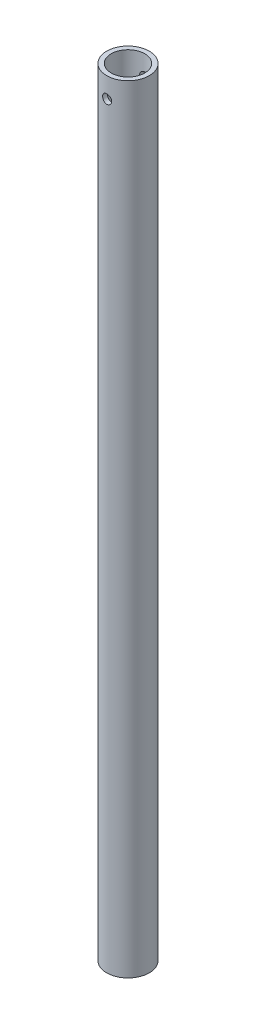
ISO-10303-21;
HEADER;
FILE_DESCRIPTION(('STEP AP214'),'2;1');
FILE_NAME('part.step','',(''),(''),'','','');
FILE_SCHEMA(('AUTOMOTIVE_DESIGN { 1 0 10303 214 1 1 1 1 }'));
ENDSEC;
DATA;
#1=APPLICATION_CONTEXT('core data for automotive mechanical design processes');
#2=APPLICATION_PROTOCOL_DEFINITION('international standard','automotive_design',2000,#1);
#3=PRODUCT_CONTEXT('',#1,'mechanical');
#4=PRODUCT('Part','Part','',(#3));
#5=PRODUCT_RELATED_PRODUCT_CATEGORY('part','',(#4));
#6=PRODUCT_DEFINITION_FORMATION('','',#4);
#7=PRODUCT_DEFINITION_CONTEXT('part definition',#1,'design');
#8=PRODUCT_DEFINITION('design','',#6,#7);
#9=PRODUCT_DEFINITION_SHAPE('','',#8);
#10=(LENGTH_UNIT() NAMED_UNIT(*) SI_UNIT(.MILLI.,.METRE.));
#11=(NAMED_UNIT(*) PLANE_ANGLE_UNIT() SI_UNIT($,.RADIAN.));
#12=(NAMED_UNIT(*) SI_UNIT($,.STERADIAN.) SOLID_ANGLE_UNIT());
#13=UNCERTAINTY_MEASURE_WITH_UNIT(LENGTH_MEASURE(1.E-05),#10,'distance_accuracy_value','');
#14=(GEOMETRIC_REPRESENTATION_CONTEXT(3) GLOBAL_UNCERTAINTY_ASSIGNED_CONTEXT((#13)) GLOBAL_UNIT_ASSIGNED_CONTEXT((#10,
#11,#12)) REPRESENTATION_CONTEXT('',''));
#15=CARTESIAN_POINT('',(0.,0.,0.));
#16=DIRECTION('',(0.,0.,1.));
#17=DIRECTION('',(1.,0.,0.));
#18=AXIS2_PLACEMENT_3D('',#15,#16,#17);
#19=CARTESIAN_POINT('',(0.,0.,0.));
#20=DIRECTION('',(0.,1.,0.));
#21=DIRECTION('',(0.,0.,1.));
#22=AXIS2_PLACEMENT_3D('',#19,#20,#21);
#23=PLANE('',#22);
#24=CARTESIAN_POINT('',(0.,0.,0.));
#25=DIRECTION('',(0.,1.,0.));
#26=DIRECTION('',(0.,0.,1.));
#27=AXIS2_PLACEMENT_3D('',#24,#25,#26);
#28=CIRCLE('',#27,13.1445);
#29=CARTESIAN_POINT('',(0.,0.,13.1445));
#30=VERTEX_POINT('',#29);
#31=EDGE_CURVE('E93',#30,#30,#28,.T.);
#32=ORIENTED_EDGE('',*,*,#31,.T.);
#33=EDGE_LOOP('',(#32));
#34=FACE_BOUND('',#33,.T.);
#35=CARTESIAN_POINT('',(0.,0.,0.));
#36=DIRECTION('',(0.,1.,0.));
#37=DIRECTION('',(0.,0.,1.));
#38=AXIS2_PLACEMENT_3D('',#35,#36,#37);
#39=CIRCLE('',#38,16.7005);
#40=CARTESIAN_POINT('',(0.,0.,16.7005));
#41=VERTEX_POINT('',#40);
#42=EDGE_CURVE('E62',#41,#41,#39,.T.);
#43=ORIENTED_EDGE('',*,*,#42,.F.);
#44=EDGE_LOOP('',(#43));
#45=FACE_BOUND('',#44,.T.);
#46=ADVANCED_FACE('F38',(#34,#45),#23,.F.);
#47=CARTESIAN_POINT('',(0.,609.6,0.));
#48=DIRECTION('',(0.,1.,0.));
#49=DIRECTION('',(0.,0.,1.));
#50=AXIS2_PLACEMENT_3D('',#47,#48,#49);
#51=PLANE('',#50);
#52=CARTESIAN_POINT('',(0.,609.6,0.));
#53=DIRECTION('',(0.,1.,0.));
#54=DIRECTION('',(0.,0.,1.));
#55=AXIS2_PLACEMENT_3D('',#52,#53,#54);
#56=CIRCLE('',#55,13.1445);
#57=CARTESIAN_POINT('',(0.,609.6,13.1445));
#58=VERTEX_POINT('',#57);
#59=EDGE_CURVE('E94',#58,#58,#56,.T.);
#60=ORIENTED_EDGE('',*,*,#59,.F.);
#61=EDGE_LOOP('',(#60));
#62=FACE_BOUND('',#61,.T.);
#63=CARTESIAN_POINT('',(0.,609.6,0.));
#64=DIRECTION('',(0.,1.,0.));
#65=DIRECTION('',(0.,0.,1.));
#66=AXIS2_PLACEMENT_3D('',#63,#64,#65);
#67=CIRCLE('',#66,16.7005);
#68=CARTESIAN_POINT('',(0.,609.6,16.7005));
#69=VERTEX_POINT('',#68);
#70=EDGE_CURVE('E57',#69,#69,#67,.T.);
#71=ORIENTED_EDGE('',*,*,#70,.T.);
#72=EDGE_LOOP('',(#71));
#73=FACE_BOUND('',#72,.T.);
#74=ADVANCED_FACE('F104',(#62,#73),#51,.T.);
#75=CARTESIAN_POINT('',(0.,0.,0.));
#76=DIRECTION('',(0.,1.,0.));
#77=DIRECTION('',(0.,0.,1.));
#78=AXIS2_PLACEMENT_3D('',#75,#76,#77);
#79=CYLINDRICAL_SURFACE('',#78,16.7005);
#80=CARTESIAN_POINT('',(0.,590.15376,16.7005));
#81=CARTESIAN_POINT('',(0.198180128467397,590.153766916919,16.7004963337488));
#82=CARTESIAN_POINT('',(0.39644485112555,590.170312231521,16.6969364344142));
#83=CARTESIAN_POINT('',(0.787350043252914,590.235991986569,16.6830790056128));
#84=CARTESIAN_POINT('',(0.979986263864115,590.285150414705,16.6727765168931));
#85=CARTESIAN_POINT('',(1.35392789600151,590.41445216763,16.6465819057805));
#86=CARTESIAN_POINT('',(1.53524466181015,590.494563844422,16.6306954941354));
#87=CARTESIAN_POINT('',(1.88185554342918,590.683399266575,16.5950509562576));
#88=CARTESIAN_POINT('',(2.04715021727184,590.792122014952,16.5752929649404));
#89=CARTESIAN_POINT('',(2.35957433760585,591.036863258493,16.533732772831));
#90=CARTESIAN_POINT('',(2.506422105691,591.173237216087,16.5119061563597));
#91=CARTESIAN_POINT('',(2.77534243826499,591.468646328024,16.4688422330848));
#92=CARTESIAN_POINT('',(2.89741287037584,591.627683430791,16.4476049771382));
#93=CARTESIAN_POINT('',(3.11454439668957,591.965971846837,16.4078842607787));
#94=CARTESIAN_POINT('',(3.20930782685882,592.145418222158,16.3894321223851));
#95=CARTESIAN_POINT('',(3.36722665713713,592.518147724438,16.3577203528158));
#96=CARTESIAN_POINT('',(3.43038565777865,592.711429272356,16.344460130189));
#97=CARTESIAN_POINT('',(3.52237626915555,593.103293597183,16.3248818041431));
#98=CARTESIAN_POINT('',(3.55170540502194,593.301754451834,16.3184631931365));
#99=CARTESIAN_POINT('',(3.57675029818604,593.700875634117,16.3129928008047));
#100=CARTESIAN_POINT('',(3.57246999855778,593.901535700977,16.3139401553009));
#101=CARTESIAN_POINT('',(3.53081840543797,594.2956765251,16.3230035707971));
#102=CARTESIAN_POINT('',(3.49402300808806,594.489221443267,16.3309948658002));
#103=CARTESIAN_POINT('',(3.38929719409495,594.867326102776,16.3530487038793));
#104=CARTESIAN_POINT('',(3.32136510009737,595.051885359462,16.3671115740326));
#105=CARTESIAN_POINT('',(3.15575979431064,595.408409635789,16.3998482170195));
#106=CARTESIAN_POINT('',(3.05786331339642,595.580267656282,16.4185563981669));
#107=CARTESIAN_POINT('',(2.83526528773563,595.905330916877,16.4584543585796));
#108=CARTESIAN_POINT('',(2.7105602424186,596.058533716948,16.4796444617611));
#109=CARTESIAN_POINT('',(2.43482710263058,596.345255326748,16.5226554031));
#110=CARTESIAN_POINT('',(2.28330880638853,596.478302568999,16.5444802322143));
#111=CARTESIAN_POINT('',(1.95986606623161,596.717172829153,16.5859026211323));
#112=CARTESIAN_POINT('',(1.78794128373359,596.822995395252,16.60550014397));
#113=CARTESIAN_POINT('',(1.42800424917503,597.004520971383,16.640319071282));
#114=CARTESIAN_POINT('',(1.23996101241435,597.08016431524,16.6555317904193));
#115=CARTESIAN_POINT('',(0.853435955602256,597.198650346792,16.6798021685141));
#116=CARTESIAN_POINT('',(0.65495558908012,597.241497588984,16.6888606821055));
#117=CARTESIAN_POINT('',(0.257237341000125,597.292494173422,16.6996810595956));
#118=CARTESIAN_POINT('',(0.0580856758665553,597.301287993776,16.7015784339077));
#119=CARTESIAN_POINT('',(-0.338841041559328,597.285671931545,16.6982415869446));
#120=CARTESIAN_POINT('',(-0.536616182056808,597.261264196515,16.6930078269279));
#121=CARTESIAN_POINT('',(-0.923055503089254,597.180472584674,16.6760821070637));
#122=CARTESIAN_POINT('',(-1.11179317921705,597.12442476495,16.6644580535049));
#123=CARTESIAN_POINT('',(-1.47718935720897,596.982315426609,16.6360520092218));
#124=CARTESIAN_POINT('',(-1.65384686043098,596.896251430197,16.6192695926952));
#125=CARTESIAN_POINT('',(-1.99274729308006,596.695196191905,16.582073127143));
#126=CARTESIAN_POINT('',(-2.15475886597971,596.579823807051,16.5616123561023));
#127=CARTESIAN_POINT('',(-2.45735342289598,596.323930935095,16.519427852075));
#128=CARTESIAN_POINT('',(-2.59793375129851,596.183407336107,16.4977039630315));
#129=CARTESIAN_POINT('',(-2.85620706916956,595.878249667119,16.4549765882197));
#130=CARTESIAN_POINT('',(-2.97345477690698,595.713235526423,16.4339924530576));
#131=CARTESIAN_POINT('',(-3.17857365224335,595.365478675312,16.3955574560704));
#132=CARTESIAN_POINT('',(-3.26644607009319,595.182736719843,16.3781064438835));
#133=CARTESIAN_POINT('',(-3.40974035959568,594.805679451086,16.3488753221426));
#134=CARTESIAN_POINT('',(-3.46534145186944,594.611434789018,16.3370639587312));
#135=CARTESIAN_POINT('',(-3.54304526295326,594.216076085678,16.3203902691574));
#136=CARTESIAN_POINT('',(-3.56515306772184,594.014963092106,16.3155268879497));
#137=CARTESIAN_POINT('',(-3.57503377692477,593.61606092668,16.3133641927147));
#138=CARTESIAN_POINT('',(-3.56351201079232,593.41828973885,16.3159094897465));
#139=CARTESIAN_POINT('',(-3.50803204004136,593.027576162751,16.3279270777278));
#140=CARTESIAN_POINT('',(-3.46407418324189,592.834633722725,16.3373992943985));
#141=CARTESIAN_POINT('',(-3.34530372068774,592.459584875812,16.3621293538191));
#142=CARTESIAN_POINT('',(-3.27058943160135,592.277446037371,16.3773687486721));
#143=CARTESIAN_POINT('',(-3.09251308657374,591.928182390882,16.4119241284166));
#144=CARTESIAN_POINT('',(-2.98914819936011,591.761059068841,16.4312405161545));
#145=CARTESIAN_POINT('',(-2.75434664612804,591.443083912176,16.4722406318213));
#146=CARTESIAN_POINT('',(-2.6224054816834,591.292609516566,16.4939629360763));
#147=CARTESIAN_POINT('',(-2.33522440786867,591.015705309254,16.5370634914949));
#148=CARTESIAN_POINT('',(-2.17997913159185,590.889281051512,16.5584416621459));
#149=CARTESIAN_POINT('',(-1.8483006757458,590.662584629503,16.5987561419888));
#150=CARTESIAN_POINT('',(-1.67163071978423,590.562652676979,16.6176592413828));
#151=CARTESIAN_POINT('',(-1.30363871792517,590.394059063511,16.6505624274905));
#152=CARTESIAN_POINT('',(-1.11232937398777,590.325370645372,16.6645667072064));
#153=CARTESIAN_POINT('',(-0.767301801157866,590.233743342312,16.6835354670588));
#154=CARTESIAN_POINT('',(-0.615477781700589,590.203805789594,16.6898583548463));
#155=CARTESIAN_POINT('',(-0.309119591274204,590.163811825327,16.6983419665027));
#156=CARTESIAN_POINT('',(-0.1545855308649,590.153754604627,16.700502859769));
#157=CARTESIAN_POINT('',(0.,590.15376,16.7005));
#158=B_SPLINE_CURVE_WITH_KNOTS('',3,(#80,#81,#82,#83,#84,#85,#86,#87,#88,#89,#90,#91,#92,#93,
#94,#95,#96,#97,#98,#99,#100,#101,#102,#103,#104,#105,#106,#107,#108,#109,#110,#111,#112,#113,
#114,#115,#116,#117,#118,#119,#120,#121,#122,#123,#124,#125,#126,#127,#128,#129,#130,#131,#132,
#133,#134,#135,#136,#137,#138,#139,#140,#141,#142,#143,#144,#145,#146,#147,#148,#149,#150,#151,
#152,#153,#154,#155,#156,#157),.UNSPECIFIED.,.T.,.F.,(4,2,2,2,2,2,2,2,2,2,2,2,2,2,2,2,2,2,2,2,2,
2,2,2,2,2,2,2,2,2,2,2,2,2,2,2,2,2,4),(0.,0.593974629123738,1.18838662522063,1.7821924691207,
2.37597762396337,2.977944459589,3.57996307951795,4.18831526537019,4.79659812895343,
5.39581628516933,5.99496414189277,6.58370815049623,7.17248387885598,7.76575810309693,
8.35910984215814,8.96470890985258,9.57031802701425,10.1771186067958,10.7838349030117,
11.3790110060325,11.9741486135033,12.5630809374933,13.1520618885512,13.7491338953982,
14.3462798273166,14.9539123201624,15.5615189480783,16.1657180887493,16.7698254725308,
17.361354257063,17.9528766985994,18.5425227716931,19.1322271348166,19.7333425626662,
20.3345966396108,20.9432341055184,21.5513493438405,22.014683490752,22.4779987790882),.UNSPECIFIED.);
#159=CARTESIAN_POINT('',(0.,590.15376,16.7005));
#160=VERTEX_POINT('',#159);
#161=EDGE_CURVE('E11',#160,#160,#158,.T.);
#162=ORIENTED_EDGE('',*,*,#161,.F.);
#163=EDGE_LOOP('',(#162));
#164=FACE_BOUND('',#163,.T.);
#165=CARTESIAN_POINT('',(0.,597.29624,-16.7005));
#166=CARTESIAN_POINT('',(0.198180128467397,597.29623308308,-16.7004963337488));
#167=CARTESIAN_POINT('',(0.39644485112555,597.279687768478,-16.6969364344142));
#168=CARTESIAN_POINT('',(0.787350043252914,597.21400801343,-16.6830790056128));
#169=CARTESIAN_POINT('',(0.979986263864115,597.164849585295,-16.6727765168931));
#170=CARTESIAN_POINT('',(1.35392789600151,597.03554783237,-16.6465819057805));
#171=CARTESIAN_POINT('',(1.53524466181015,596.955436155577,-16.6306954941354));
#172=CARTESIAN_POINT('',(1.88185554342918,596.766600733424,-16.5950509562576));
#173=CARTESIAN_POINT('',(2.04715021727184,596.657877985048,-16.5752929649404));
#174=CARTESIAN_POINT('',(2.35957433760585,596.413136741506,-16.533732772831));
#175=CARTESIAN_POINT('',(2.506422105691,596.276762783912,-16.5119061563597));
#176=CARTESIAN_POINT('',(2.77534243826499,595.981353671976,-16.4688422330848));
#177=CARTESIAN_POINT('',(2.89741287037584,595.822316569209,-16.4476049771382));
#178=CARTESIAN_POINT('',(3.11454439668957,595.484028153163,-16.4078842607787));
#179=CARTESIAN_POINT('',(3.20930782685882,595.304581777842,-16.3894321223851));
#180=CARTESIAN_POINT('',(3.36722665713713,594.931852275562,-16.3577203528158));
#181=CARTESIAN_POINT('',(3.43038565777865,594.738570727643,-16.344460130189));
#182=CARTESIAN_POINT('',(3.52237626915555,594.346706402817,-16.3248818041431));
#183=CARTESIAN_POINT('',(3.55170540502194,594.148245548166,-16.3184631931365));
#184=CARTESIAN_POINT('',(3.57675029818604,593.749124365883,-16.3129928008047));
#185=CARTESIAN_POINT('',(3.57246999855779,593.548464299023,-16.3139401553009));
#186=CARTESIAN_POINT('',(3.53081840543798,593.154323474899,-16.3230035707971));
#187=CARTESIAN_POINT('',(3.49402300808809,592.960778556733,-16.3309948658002));
#188=CARTESIAN_POINT('',(3.38929719409502,592.582673897224,-16.3530487038793));
#189=CARTESIAN_POINT('',(3.32136510009741,592.398114640538,-16.3671115740326));
#190=CARTESIAN_POINT('',(3.15575979431064,592.041590364211,-16.3998482170195));
#191=CARTESIAN_POINT('',(3.05786331339642,591.869732343717,-16.4185563981669));
#192=CARTESIAN_POINT('',(2.83526528773563,591.544669083122,-16.4584543585796));
#193=CARTESIAN_POINT('',(2.7105602424186,591.391466283051,-16.4796444617611));
#194=CARTESIAN_POINT('',(2.43482710263058,591.104744673252,-16.5226554031));
#195=CARTESIAN_POINT('',(2.28330880638853,590.971697431,-16.5444802322143));
#196=CARTESIAN_POINT('',(1.95986606623161,590.732827170847,-16.5859026211323));
#197=CARTESIAN_POINT('',(1.78794128373359,590.627004604748,-16.60550014397));
#198=CARTESIAN_POINT('',(1.42800424917501,590.445479028617,-16.640319071282));
#199=CARTESIAN_POINT('',(1.23996101241431,590.36983568476,-16.6555317904193));
#200=CARTESIAN_POINT('',(0.853435955602212,590.251349653207,-16.6798021685141));
#201=CARTESIAN_POINT('',(0.654955589080099,590.208502411016,-16.6888606821055));
#202=CARTESIAN_POINT('',(0.257237341000129,590.157505826577,-16.6996810595956));
#203=CARTESIAN_POINT('',(0.0580856758665614,590.148712006224,-16.7015784339077));
#204=CARTESIAN_POINT('',(-0.338841041559322,590.164328068455,-16.6982415869446));
#205=CARTESIAN_POINT('',(-0.536616182056806,590.188735803485,-16.6930078269279));
#206=CARTESIAN_POINT('',(-0.923055503089254,590.269527415326,-16.6760821070637));
#207=CARTESIAN_POINT('',(-1.11179317921705,590.325575235049,-16.6644580535049));
#208=CARTESIAN_POINT('',(-1.47718935720897,590.467684573391,-16.6360520092218));
#209=CARTESIAN_POINT('',(-1.65384686043098,590.553748569802,-16.6192695926952));
#210=CARTESIAN_POINT('',(-1.99274729308006,590.754803808094,-16.582073127143));
#211=CARTESIAN_POINT('',(-2.15475886597971,590.870176192948,-16.5616123561023));
#212=CARTESIAN_POINT('',(-2.45735342289598,591.126069064905,-16.519427852075));
#213=CARTESIAN_POINT('',(-2.59793375129851,591.266592663893,-16.4977039630315));
#214=CARTESIAN_POINT('',(-2.85620706916956,591.57175033288,-16.4549765882197));
#215=CARTESIAN_POINT('',(-2.97345477690698,591.736764473577,-16.4339924530576));
#216=CARTESIAN_POINT('',(-3.17857365224335,592.084521324688,-16.3955574560704));
#217=CARTESIAN_POINT('',(-3.26644607009319,592.267263280157,-16.3781064438835));
#218=CARTESIAN_POINT('',(-3.40974035959568,592.644320548914,-16.3488753221426));
#219=CARTESIAN_POINT('',(-3.46534145186944,592.838565210982,-16.3370639587312));
#220=CARTESIAN_POINT('',(-3.54304526295326,593.233923914322,-16.3203902691574));
#221=CARTESIAN_POINT('',(-3.56515306772184,593.435036907894,-16.3155268879497));
#222=CARTESIAN_POINT('',(-3.57503377692477,593.833939073319,-16.3133641927147));
#223=CARTESIAN_POINT('',(-3.56351201079232,594.03171026115,-16.3159094897465));
#224=CARTESIAN_POINT('',(-3.50803204004136,594.422423837249,-16.3279270777278));
#225=CARTESIAN_POINT('',(-3.46407418324189,594.615366277274,-16.3373992943985));
#226=CARTESIAN_POINT('',(-3.34530372068771,594.990415124188,-16.3621293538191));
#227=CARTESIAN_POINT('',(-3.27058943160127,595.172553962629,-16.3773687486721));
#228=CARTESIAN_POINT('',(-3.09251308657364,595.521817609118,-16.4119241284166));
#229=CARTESIAN_POINT('',(-2.98914819936006,595.688940931159,-16.4312405161545));
#230=CARTESIAN_POINT('',(-2.75434664612805,596.006916087824,-16.4722406318213));
#231=CARTESIAN_POINT('',(-2.6224054816834,596.157390483433,-16.4939629360763));
#232=CARTESIAN_POINT('',(-2.33522440786867,596.434294690746,-16.5370634914949));
#233=CARTESIAN_POINT('',(-2.17997913159185,596.560718948487,-16.5584416621459));
#234=CARTESIAN_POINT('',(-1.8483006757458,596.787415370497,-16.5987561419888));
#235=CARTESIAN_POINT('',(-1.67163071978423,596.887347323021,-16.6176592413828));
#236=CARTESIAN_POINT('',(-1.30363871792517,597.055940936489,-16.6505624274905));
#237=CARTESIAN_POINT('',(-1.11232937398777,597.124629354628,-16.6645667072064));
#238=CARTESIAN_POINT('',(-0.767301801157866,597.216256657688,-16.6835354670588));
#239=CARTESIAN_POINT('',(-0.615477781700589,597.246194210406,-16.6898583548463));
#240=CARTESIAN_POINT('',(-0.309119591274204,597.286188174673,-16.6983419665027));
#241=CARTESIAN_POINT('',(-0.1545855308649,597.296245395373,-16.700502859769));
#242=CARTESIAN_POINT('',(0.,597.29624,-16.7005));
#243=B_SPLINE_CURVE_WITH_KNOTS('',3,(#165,#166,#167,#168,#169,#170,#171,#172,#173,#174,#175,
#176,#177,#178,#179,#180,#181,#182,#183,#184,#185,#186,#187,#188,#189,#190,#191,#192,#193,#194,
#195,#196,#197,#198,#199,#200,#201,#202,#203,#204,#205,#206,#207,#208,#209,#210,#211,#212,#213,
#214,#215,#216,#217,#218,#219,#220,#221,#222,#223,#224,#225,#226,#227,#228,#229,#230,#231,#232,
#233,#234,#235,#236,#237,#238,#239,#240,#241,#242),.UNSPECIFIED.,.T.,.F.,(4,2,2,2,2,2,2,2,2,2,2,
2,2,2,2,2,2,2,2,2,2,2,2,2,2,2,2,2,2,2,2,2,2,2,2,2,2,2,4),(0.,0.593974629123738,1.18838662522063,
1.7821924691207,2.37597762396337,2.977944459589,3.57996307951795,4.18831526537019,
4.79659812895343,5.39581628516933,5.99496414189277,6.58370815049589,7.17248387885598,
7.76575810309693,8.35910984215813,8.96470890985258,9.57031802701425,10.1771186067958,
10.7838349030117,11.3790110060325,11.9741486135033,12.5630809374933,13.1520618885512,
13.7491338953982,14.3462798273166,14.9539123201624,15.5615189480783,16.1657180887493,
16.7698254725308,17.361354257063,17.9528766985994,18.5425227716934,19.1322271348166,
19.7333425626662,20.3345966396108,20.9432341055184,21.5513493438405,22.014683490752,
22.4779987790882),.UNSPECIFIED.);
#244=CARTESIAN_POINT('',(0.,597.29624,-16.7005));
#245=VERTEX_POINT('',#244);
#246=EDGE_CURVE('E50',#245,#245,#243,.T.);
#247=ORIENTED_EDGE('',*,*,#246,.F.);
#248=EDGE_LOOP('',(#247));
#249=FACE_BOUND('',#248,.T.);
#250=ORIENTED_EDGE('',*,*,#70,.F.);
#251=EDGE_LOOP('',(#250));
#252=FACE_BOUND('',#251,.T.);
#253=ORIENTED_EDGE('',*,*,#42,.T.);
#254=EDGE_LOOP('',(#253));
#255=FACE_BOUND('',#254,.T.);
#256=ADVANCED_FACE('F68',(#164,#249,#252,#255),#79,.T.);
#257=CARTESIAN_POINT('',(0.,0.,0.));
#258=DIRECTION('',(0.,1.,0.));
#259=DIRECTION('',(0.,0.,1.));
#260=AXIS2_PLACEMENT_3D('',#257,#258,#259);
#261=CYLINDRICAL_SURFACE('',#260,13.1445);
#262=CARTESIAN_POINT('',(0.,590.15376,13.1445));
#263=CARTESIAN_POINT('',(0.196734814294615,590.153764378364,13.1444971760718));
#264=CARTESIAN_POINT('',(0.393516001561489,590.170071213926,13.1400398888218));
#265=CARTESIAN_POINT('',(0.78140069505591,590.234746649612,13.1226921056815));
#266=CARTESIAN_POINT('',(0.972501578845284,590.28312982546,13.109797775972));
#267=CARTESIAN_POINT('',(1.34337133102817,590.410262055463,13.0769976305413));
#268=CARTESIAN_POINT('',(1.52315475811126,590.488971129889,13.0571010491192));
#269=CARTESIAN_POINT('',(1.86696995059322,590.674370376731,13.0123940642889));
#270=CARTESIAN_POINT('',(2.03100050744225,590.781062693664,12.9875832843131));
#271=CARTESIAN_POINT('',(2.34258889548332,591.022101565236,12.9350564225104));
#272=CARTESIAN_POINT('',(2.48971499848659,591.156995073441,12.9072892095964));
#273=CARTESIAN_POINT('',(2.75955970986045,591.449438514433,12.8523038782919));
#274=CARTESIAN_POINT('',(2.8822750478221,591.606991478134,12.825085833914));
#275=CARTESIAN_POINT('',(3.10194349061531,591.9437571414,12.7737550574884));
#276=CARTESIAN_POINT('',(3.19839560101738,592.123307350828,12.7497067033389));
#277=CARTESIAN_POINT('',(3.35957111332819,592.496835208983,12.7081917492458));
#278=CARTESIAN_POINT('',(3.42430061388786,592.690810076313,12.690723884357));
#279=CARTESIAN_POINT('',(3.51868580557237,593.082889538336,12.6648763017439));
#280=CARTESIAN_POINT('',(3.54912621235336,593.280791518654,12.6562936327321));
#281=CARTESIAN_POINT('',(3.57651621518975,593.6790650825,12.6485822015427));
#282=CARTESIAN_POINT('',(3.57347232770244,593.879436177925,12.6494515998757));
#283=CARTESIAN_POINT('',(3.53460216942576,594.270799554918,12.6603646788483));
#284=CARTESIAN_POINT('',(3.49973009718289,594.46189524522,12.6701413083803));
#285=CARTESIAN_POINT('',(3.39972365258786,594.835415910685,12.6973390361955));
#286=CARTESIAN_POINT('',(3.33458677974115,595.017840168035,12.7147607661145));
#287=CARTESIAN_POINT('',(3.17513315267934,595.371304632213,12.7555173528351));
#288=CARTESIAN_POINT('',(3.08048552975019,595.542187589351,12.7789186859865));
#289=CARTESIAN_POINT('',(2.86492777444314,595.865978804228,12.8289625547442));
#290=CARTESIAN_POINT('',(2.74401229573363,596.018883393026,12.8556057496846));
#291=CARTESIAN_POINT('',(2.47449233792716,596.307823773253,12.9102388632684));
#292=CARTESIAN_POINT('',(2.32508786696849,596.443111584833,12.9382438103255));
#293=CARTESIAN_POINT('',(2.00536825434316,596.686868197862,12.9916360733779));
#294=CARTESIAN_POINT('',(1.83505222578218,596.795335861236,13.0170232782664));
#295=CARTESIAN_POINT('',(1.47715710542602,596.982719974395,13.062485740196));
#296=CARTESIAN_POINT('',(1.28950144001944,597.061496698781,13.082535753751));
#297=CARTESIAN_POINT('',(0.90293991327048,597.186166243206,13.1148824767922));
#298=CARTESIAN_POINT('',(0.704036618047962,597.232066531528,13.1271809470595));
#299=CARTESIAN_POINT('',(0.307005770423006,597.288495717986,13.1423708245684));
#300=CARTESIAN_POINT('',(0.109032804050557,597.300041065656,13.1455324762205));
#301=CARTESIAN_POINT('',(-0.28602216467824,597.29024571559,13.142871731123));
#302=CARTESIAN_POINT('',(-0.483104260612896,597.268908556362,13.1370503010485));
#303=CARTESIAN_POINT('',(-0.867125214790368,597.194786113737,13.1172524341221));
#304=CARTESIAN_POINT('',(-1.05418259206123,597.142571656327,13.1034241144087));
#305=CARTESIAN_POINT('',(-1.41686192640417,597.008843085413,13.0691848499248));
#306=CARTESIAN_POINT('',(-1.59248261834892,596.927325736901,13.0487731783849));
#307=CARTESIAN_POINT('',(-1.93122301109764,596.735446138518,13.0030028146807));
#308=CARTESIAN_POINT('',(-2.09401973917127,596.624536059711,12.9775527757279));
#309=CARTESIAN_POINT('',(-2.39904652627533,596.377704577267,12.9246455200942));
#310=CARTESIAN_POINT('',(-2.54127235239184,596.241778038985,12.8971878920528));
#311=CARTESIAN_POINT('',(-2.80543193446934,595.944022463773,12.8423593352832));
#312=CARTESIAN_POINT('',(-2.92664744105825,595.781550178195,12.8150146133221));
#313=CARTESIAN_POINT('',(-3.14011415223446,595.437988828262,12.764389695297));
#314=CARTESIAN_POINT('',(-3.23236652505416,595.256900515177,12.7411093353133));
#315=CARTESIAN_POINT('',(-3.38459637053665,594.88211865391,12.7015187280531));
#316=CARTESIAN_POINT('',(-3.44475766310845,594.688504180139,12.6851688954922));
#317=CARTESIAN_POINT('',(-3.53151200920316,594.293384204233,12.6612940222037));
#318=CARTESIAN_POINT('',(-3.55811404205927,594.091880827789,12.6537666209275));
#319=CARTESIAN_POINT('',(-3.57646398791924,593.694071152092,12.6485913361503));
#320=CARTESIAN_POINT('',(-3.56936849944809,593.497821685787,12.6506155957682));
#321=CARTESIAN_POINT('',(-3.52321893875573,593.109430438564,12.6635449558301));
#322=CARTESIAN_POINT('',(-3.48416574913394,592.917288544355,12.6744498110121));
#323=CARTESIAN_POINT('',(-3.37589153725019,592.544084545661,12.7037127676964));
#324=CARTESIAN_POINT('',(-3.30692439104642,592.362943512752,12.7220080596442));
#325=CARTESIAN_POINT('',(-3.14097669509761,592.014664562613,12.7639899119015));
#326=CARTESIAN_POINT('',(-3.04399160019914,591.847528923058,12.7876773468078));
#327=CARTESIAN_POINT('',(-2.82129307562297,591.526506098928,12.8386756166972));
#328=CARTESIAN_POINT('',(-2.69479461045327,591.373177485765,12.8660748386042));
#329=CARTESIAN_POINT('',(-2.41814160852195,591.089548331336,12.9209258439768));
#330=CARTESIAN_POINT('',(-2.26798127911552,590.959253445557,12.9483776386828));
#331=CARTESIAN_POINT('',(-1.94419792421026,590.722507090148,13.0009784037949));
#332=CARTESIAN_POINT('',(-1.77012364619755,590.616656922584,13.0260617985361));
#333=CARTESIAN_POINT('',(-1.40597356725947,590.435888341459,13.0703733534209));
#334=CARTESIAN_POINT('',(-1.21590773544791,590.360950826499,13.0896051274362));
#335=CARTESIAN_POINT('',(-0.855560772325295,590.253478556845,13.1176732796793));
#336=CARTESIAN_POINT('',(-0.686776937718823,590.216172927574,13.127658628125));
#337=CARTESIAN_POINT('',(-0.34534036774025,590.166313052653,13.1410728766577));
#338=CARTESIAN_POINT('',(-0.172688048625005,590.153756156801,13.1445024787613));
#339=CARTESIAN_POINT('',(0.,590.15376,13.1445));
#340=B_SPLINE_CURVE_WITH_KNOTS('',3,(#262,#263,#264,#265,#266,#267,#268,#269,#270,#271,#272,
#273,#274,#275,#276,#277,#278,#279,#280,#281,#282,#283,#284,#285,#286,#287,#288,#289,#290,#291,
#292,#293,#294,#295,#296,#297,#298,#299,#300,#301,#302,#303,#304,#305,#306,#307,#308,#309,#310,
#311,#312,#313,#314,#315,#316,#317,#318,#319,#320,#321,#322,#323,#324,#325,#326,#327,#328,#329,
#330,#331,#332,#333,#334,#335,#336,#337,#338,#339),.UNSPECIFIED.,.T.,.F.,(4,2,2,2,2,2,2,2,2,2,2,
2,2,2,2,2,2,2,2,2,2,2,2,2,2,2,2,2,2,2,2,2,2,2,2,2,2,2,4),(0.,0.589571005769807,1.17941010071858,
1.76847423558072,2.35758352701369,2.95940225322194,3.56130155329697,4.1739854534758,
4.78655151932546,5.38479440061382,5.98292085850762,6.56368441760561,7.14449596824427,
7.73206901069686,8.31976175490152,8.92738608914993,9.5350362026759,10.1455112313923,
10.755847539255,11.3479370309964,11.9399628120508,12.5213717046057,13.102844803804,
13.6960278079939,14.2893326994611,14.9000544160147,15.5107514958495,16.1179118389065,
16.724909691724,17.3112271760549,17.8975284681695,18.478948378811,19.0604626621027,
19.6596887061883,20.2590616749511,20.8718975995607,21.484354274241,22.0019178335628,
22.5194259669215),.UNSPECIFIED.);
#341=CARTESIAN_POINT('',(0.,590.15376,13.1445));
#342=VERTEX_POINT('',#341);
#343=EDGE_CURVE('E87',#342,#342,#340,.T.);
#344=ORIENTED_EDGE('',*,*,#343,.T.);
#345=EDGE_LOOP('',(#344));
#346=FACE_BOUND('',#345,.T.);
#347=CARTESIAN_POINT('',(3.57123999999999,593.725,-12.6500642335286));
#348=CARTESIAN_POINT('',(3.57123554935219,593.528416358488,-12.6500674973936));
#349=CARTESIAN_POINT('',(3.55495289596663,593.331786210478,-12.6546967420866));
#350=CARTESIAN_POINT('',(3.49038220425838,592.944214680323,-12.6726555532177));
#351=CARTESIAN_POINT('',(3.44207890138384,592.75327605677,-12.685989269115));
#352=CARTESIAN_POINT('',(3.31518003562076,592.382750676962,-12.7197378955362));
#353=CARTESIAN_POINT('',(3.23662816967044,592.203147978496,-12.7401425871242));
#354=CARTESIAN_POINT('',(3.05159993273667,591.859639615196,-12.7857209307242));
#355=CARTESIAN_POINT('',(2.94512109184095,591.695735340512,-12.8108950044942));
#356=CARTESIAN_POINT('',(2.70430500280925,591.384021408672,-12.8639080554163));
#357=CARTESIAN_POINT('',(2.56937270051415,591.23667964235,-12.8917957025217));
#358=CARTESIAN_POINT('',(2.27675904351758,590.96641387182,-12.9466742234978));
#359=CARTESIAN_POINT('',(2.11907525720518,590.843492480931,-12.9736650011338));
#360=CARTESIAN_POINT('',(1.7821781851315,590.62359411841,-13.0242531648666));
#361=CARTESIAN_POINT('',(1.60264970147265,590.527084019782,-13.0477864510996));
#362=CARTESIAN_POINT('',(1.22916800498836,590.365795496759,-13.088248625138));
#363=CARTESIAN_POINT('',(1.03521732756619,590.301011510072,-13.1051786705319));
#364=CARTESIAN_POINT('',(0.64328232829537,590.206533382937,-13.1301826323045));
#365=CARTESIAN_POINT('',(0.445502990019399,590.176042922495,-13.138457200939));
#366=CARTESIAN_POINT('',(0.0474747951687445,590.148510182131,-13.1459201725723));
#367=CARTESIAN_POINT('',(-0.152773626944238,590.151462099251,-13.1451101519387));
#368=CARTESIAN_POINT('',(-0.5445067058346,590.190173309476,-13.1346414884009));
#369=CARTESIAN_POINT('',(-0.736083564599259,590.225071976656,-13.1252149781989));
#370=CARTESIAN_POINT('',(-1.11055212802383,590.325293455477,-13.098847590854));
#371=CARTESIAN_POINT('',(-1.29344332753023,590.39061803429,-13.0819062772451));
#372=CARTESIAN_POINT('',(-1.64752408821363,590.55048534327,-13.0420718955079));
#373=CARTESIAN_POINT('',(-1.81857520056092,590.645319418061,-13.0191198587673));
#374=CARTESIAN_POINT('',(-2.14262658062465,590.861289209519,-12.9697316254832));
#375=CARTESIAN_POINT('',(-2.29562320527668,590.982430220484,-12.9432947280292));
#376=CARTESIAN_POINT('',(-2.58436010547215,591.252129113019,-12.8888036566397));
#377=CARTESIAN_POINT('',(-2.71939597236239,591.401437035092,-12.8607247896261));
#378=CARTESIAN_POINT('',(-2.96268783111135,591.720867943205,-12.8068704359416));
#379=CARTESIAN_POINT('',(-3.07094205916329,591.890992299088,-12.7810951010501));
#380=CARTESIAN_POINT('',(-3.25816145646974,592.248800632232,-12.7346641600397));
#381=CARTESIAN_POINT('',(-3.33692823550873,592.436593275244,-12.7140435321151));
#382=CARTESIAN_POINT('',(-3.46153783954766,592.823457047487,-12.6806878112466));
#383=CARTESIAN_POINT('',(-3.50738918819097,593.022525242432,-12.6679506769438));
#384=CARTESIAN_POINT('',(-3.56363752310063,593.419684472913,-12.6522409234042));
#385=CARTESIAN_POINT('',(-3.57508817534394,593.617614968085,-12.6489782177927));
#386=CARTESIAN_POINT('',(-3.5651188328946,594.012563920329,-12.6517918273884));
#387=CARTESIAN_POINT('',(-3.54370248845347,594.209582476244,-12.6578671055071));
#388=CARTESIAN_POINT('',(-3.46953744453267,594.593008120043,-12.6783912746675));
#389=CARTESIAN_POINT('',(-3.4174285033955,594.779549011449,-12.6926690467682));
#390=CARTESIAN_POINT('',(-3.28407996687795,595.141241302753,-12.727820823844));
#391=CARTESIAN_POINT('',(-3.20283646144874,595.316391170171,-12.7486957141508));
#392=CARTESIAN_POINT('',(-3.01140637825196,595.654720250251,-12.7952802914005));
#393=CARTESIAN_POINT('',(-2.90060457377367,595.817537410647,-12.8210889843697));
#394=CARTESIAN_POINT('',(-2.653961068663,596.12265424225,-12.8744032568262));
#395=CARTESIAN_POINT('',(-2.51811447538421,596.264949894763,-12.9019091671751));
#396=CARTESIAN_POINT('',(-2.2203522239269,596.529391800837,-12.9565221824062));
#397=CARTESIAN_POINT('',(-2.05777423694694,596.650801466638,-12.9835922789003));
#398=CARTESIAN_POINT('',(-1.71393679049281,596.864610017915,-13.0334351634827));
#399=CARTESIAN_POINT('',(-1.53267832596573,596.957010447402,-13.0562081802565));
#400=CARTESIAN_POINT('',(-1.15790060845889,597.109318453211,-13.0947441664559));
#401=CARTESIAN_POINT('',(-0.964486257563593,597.169470224132,-13.1105596511612));
#402=CARTESIAN_POINT('',(-0.569798840390788,597.256272732606,-13.1336299965622));
#403=CARTESIAN_POINT('',(-0.36852759816859,597.282931198828,-13.1408868321654));
#404=CARTESIAN_POINT('',(0.029290099360577,597.301490936027,-13.1459250494898));
#405=CARTESIAN_POINT('',(0.225783210109762,597.294470770219,-13.1440004783609));
#406=CARTESIAN_POINT('',(0.61468240722859,597.248387475701,-13.1315611435563));
#407=CARTESIAN_POINT('',(0.807088657265576,597.209325632663,-13.1210467245479));
#408=CARTESIAN_POINT('',(1.18100280512577,597.100886812443,-13.0926713393227));
#409=CARTESIAN_POINT('',(1.36258074057843,597.031736022344,-13.0748652443732));
#410=CARTESIAN_POINT('',(1.71166008784081,596.865283745225,-13.0337648297377));
#411=CARTESIAN_POINT('',(1.87915946424631,596.76797819674,-13.0104697183238));
#412=CARTESIAN_POINT('',(2.20031827580747,596.544863265669,-12.960079048685));
#413=CARTESIAN_POINT('',(2.3534709684445,596.418344144653,-12.9328966527437));
#414=CARTESIAN_POINT('',(2.63673608218994,596.141729646182,-12.8781349929709));
#415=CARTESIAN_POINT('',(2.76684235287572,595.99162799534,-12.8505556253159));
#416=CARTESIAN_POINT('',(3.00330007017803,595.667944153682,-12.7973875026566));
#417=CARTESIAN_POINT('',(3.10903422107503,595.493900140109,-12.7718593523776));
#418=CARTESIAN_POINT('',(3.28959344376972,595.129833405127,-12.7265540282442));
#419=CARTESIAN_POINT('',(3.36443799752681,594.939820846333,-12.7067732318915));
#420=CARTESIAN_POINT('',(3.47172465047915,594.579695140749,-12.6778381508413));
#421=CARTESIAN_POINT('',(3.50895322861753,594.411087638765,-12.6675091265274));
#422=CARTESIAN_POINT('',(3.55871132107383,594.069998373812,-12.6536211565262));
#423=CARTESIAN_POINT('',(3.5712439057819,593.897517095157,-12.6500613692389));
#424=CARTESIAN_POINT('',(3.57123999999999,593.725,-12.6500642335286));
#425=B_SPLINE_CURVE_WITH_KNOTS('',3,(#347,#348,#349,#350,#351,#352,#353,#354,#355,#356,#357,
#358,#359,#360,#361,#362,#363,#364,#365,#366,#367,#368,#369,#370,#371,#372,#373,#374,#375,#376,
#377,#378,#379,#380,#381,#382,#383,#384,#385,#386,#387,#388,#389,#390,#391,#392,#393,#394,#395,
#396,#397,#398,#399,#400,#401,#402,#403,#404,#405,#406,#407,#408,#409,#410,#411,#412,#413,#414,
#415,#416,#417,#418,#419,#420,#421,#422,#423,#424),.UNSPECIFIED.,.T.,.F.,(4,2,2,2,2,2,2,2,2,2,2,
2,2,2,2,2,2,2,2,2,2,2,2,2,2,2,2,2,2,2,2,2,2,2,2,2,2,2,4),(0.,0.589116276580594,1.17851359271103,
1.76706264305046,2.35566376329737,2.95807601094113,3.56055269037045,4.17307708878991,
4.78549405962263,5.38337610624441,5.98115440933694,6.56328821555388,7.14545583701725,
7.73356398684924,8.32179060393215,8.9287433220016,9.53573600261807,10.1467420840936,
10.7575898848361,11.3495268035929,11.9413979858207,12.5213481871038,13.1013762506385,
13.6945728560105,14.2878854688517,14.8990809516792,15.5102438982291,16.1167111566413,
16.723038445395,17.3100800788097,17.8970981583542,18.4797776993988,19.0625413368116,
19.661317642701,20.2602535046858,20.8730073429488,21.4853741267762,22.0024327490479,
22.5194270826771),.UNSPECIFIED.);
#426=CARTESIAN_POINT('',(3.57123999999999,593.725,-12.6500642335286));
#427=VERTEX_POINT('',#426);
#428=EDGE_CURVE('E82',#427,#427,#425,.T.);
#429=ORIENTED_EDGE('',*,*,#428,.T.);
#430=EDGE_LOOP('',(#429));
#431=FACE_BOUND('',#430,.T.);
#432=ORIENTED_EDGE('',*,*,#59,.T.);
#433=EDGE_LOOP('',(#432));
#434=FACE_BOUND('',#433,.T.);
#435=ORIENTED_EDGE('',*,*,#31,.F.);
#436=EDGE_LOOP('',(#435));
#437=FACE_BOUND('',#436,.T.);
#438=ADVANCED_FACE('F75',(#346,#431,#434,#437),#261,.F.);
#439=CARTESIAN_POINT('',(0.,593.725,16.7005));
#440=DIRECTION('',(0.,0.,1.));
#441=DIRECTION('',(1.,0.,0.));
#442=AXIS2_PLACEMENT_3D('',#439,#440,#441);
#443=CYLINDRICAL_SURFACE('',#442,3.57123999999999);
#444=ORIENTED_EDGE('',*,*,#246,.T.);
#445=EDGE_LOOP('',(#444));
#446=FACE_BOUND('',#445,.T.);
#447=ORIENTED_EDGE('',*,*,#428,.F.);
#448=EDGE_LOOP('',(#447));
#449=FACE_BOUND('',#448,.T.);
#450=ADVANCED_FACE('F74',(#446,#449),#443,.F.);
#451=ORIENTED_EDGE('',*,*,#161,.T.);
#452=EDGE_LOOP('',(#451));
#453=FACE_BOUND('',#452,.T.);
#454=ORIENTED_EDGE('',*,*,#343,.F.);
#455=EDGE_LOOP('',(#454));
#456=FACE_BOUND('',#455,.T.);
#457=ADVANCED_FACE('F71',(#453,#456),#443,.F.);
#458=CLOSED_SHELL('',(#46,#74,#256,#438,#450,#457));
#459=MANIFOLD_SOLID_BREP('B2',#458);
#460=ADVANCED_BREP_SHAPE_REPRESENTATION('',(#18,#459),#14);
#461=SHAPE_DEFINITION_REPRESENTATION(#9,#460);
ENDSEC;
END-ISO-10303-21;
